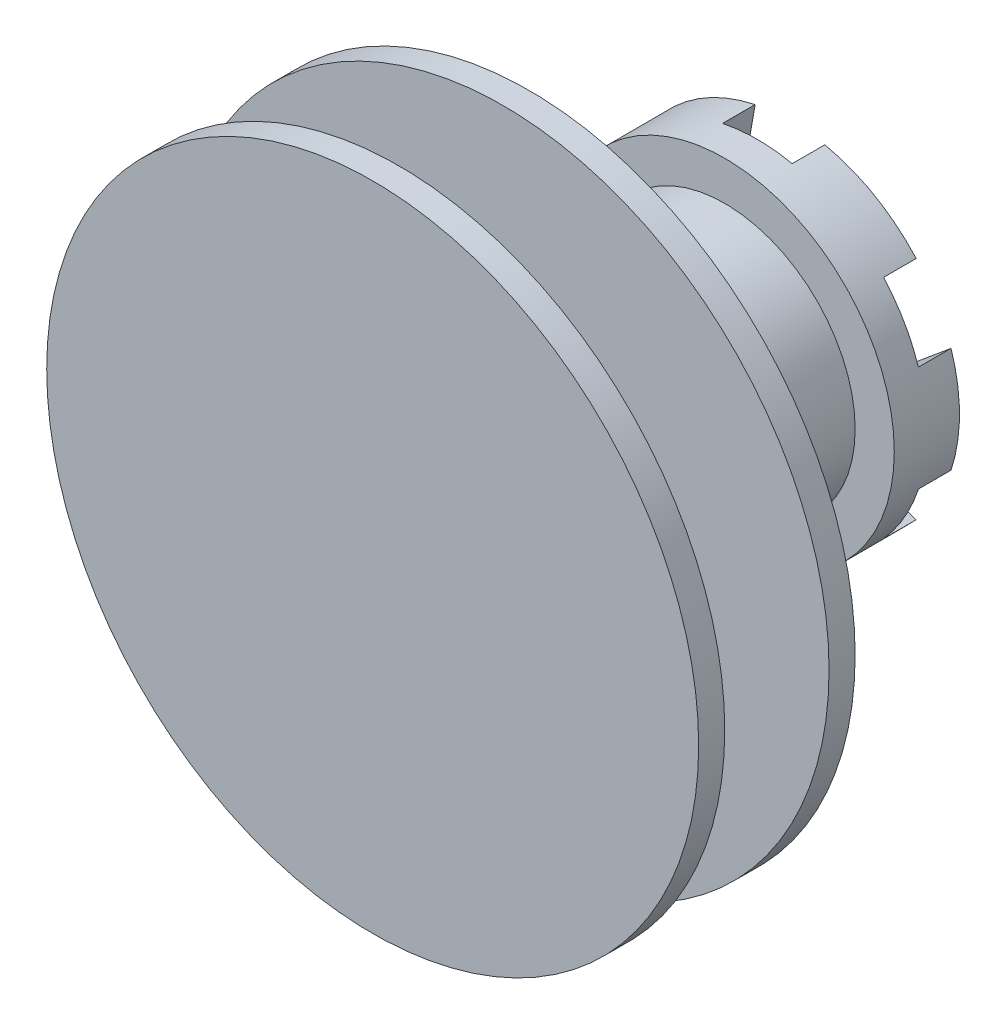
ISO-10303-21;
HEADER;
FILE_DESCRIPTION(('STEP AP214'),'2;1');
FILE_NAME('part.step','',(''),(''),'','','');
FILE_SCHEMA(('AUTOMOTIVE_DESIGN { 1 0 10303 214 1 1 1 1 }'));
ENDSEC;
DATA;
#1=APPLICATION_CONTEXT('core data for automotive mechanical design processes');
#2=APPLICATION_PROTOCOL_DEFINITION('international standard','automotive_design',2000,#1);
#3=PRODUCT_CONTEXT('',#1,'mechanical');
#4=PRODUCT('Part','Part','',(#3));
#5=PRODUCT_RELATED_PRODUCT_CATEGORY('part','',(#4));
#6=PRODUCT_DEFINITION_FORMATION('','',#4);
#7=PRODUCT_DEFINITION_CONTEXT('part definition',#1,'design');
#8=PRODUCT_DEFINITION('design','',#6,#7);
#9=PRODUCT_DEFINITION_SHAPE('','',#8);
#10=(LENGTH_UNIT() NAMED_UNIT(*) SI_UNIT(.MILLI.,.METRE.));
#11=(NAMED_UNIT(*) PLANE_ANGLE_UNIT() SI_UNIT($,.RADIAN.));
#12=(NAMED_UNIT(*) SI_UNIT($,.STERADIAN.) SOLID_ANGLE_UNIT());
#13=UNCERTAINTY_MEASURE_WITH_UNIT(LENGTH_MEASURE(1.E-05),#10,'distance_accuracy_value','');
#14=(GEOMETRIC_REPRESENTATION_CONTEXT(3) GLOBAL_UNCERTAINTY_ASSIGNED_CONTEXT((#13)) GLOBAL_UNIT_ASSIGNED_CONTEXT((#10,
#11,#12)) REPRESENTATION_CONTEXT('',''));
#15=CARTESIAN_POINT('',(0.,0.,0.));
#16=DIRECTION('',(0.,0.,1.));
#17=DIRECTION('',(1.,0.,0.));
#18=AXIS2_PLACEMENT_3D('',#15,#16,#17);
#19=CARTESIAN_POINT('',(0.,0.,5.));
#20=DIRECTION('',(0.,0.,-1.));
#21=DIRECTION('',(-1.,0.,0.));
#22=AXIS2_PLACEMENT_3D('',#19,#20,#21);
#23=CYLINDRICAL_SURFACE('',#22,13.);
#24=CARTESIAN_POINT('',(0.,0.,5.));
#25=DIRECTION('',(0.,0.,1.));
#26=DIRECTION('',(1.,0.,0.));
#27=AXIS2_PLACEMENT_3D('',#24,#25,#26);
#28=CIRCLE('',#27,13.);
#29=CARTESIAN_POINT('',(13.,0.,5.));
#30=VERTEX_POINT('',#29);
#31=EDGE_CURVE('E212',#30,#30,#28,.T.);
#32=ORIENTED_EDGE('',*,*,#31,.F.);
#33=EDGE_LOOP('',(#32));
#34=FACE_BOUND('',#33,.T.);
#35=DIRECTION('',(0.,0.,-1.));
#36=VECTOR('',#35,1.);
#37=CARTESIAN_POINT('',(9.6820807161264,8.67509729089037,5.));
#38=LINE('',#37,#36);
#39=CARTESIAN_POINT('',(9.6820807161264,8.67509729089037,0.));
#40=VERTEX_POINT('',#39);
#41=CARTESIAN_POINT('',(9.6820807161264,8.67509729089037,2.5));
#42=VERTEX_POINT('',#41);
#43=EDGE_CURVE('E57',#40,#42,#38,.F.);
#44=ORIENTED_EDGE('',*,*,#43,.F.);
#45=CARTESIAN_POINT('',(0.,0.,0.));
#46=DIRECTION('',(0.,0.,1.));
#47=DIRECTION('',(1.,0.,0.));
#48=AXIS2_PLACEMENT_3D('',#45,#46,#47);
#49=CIRCLE('',#48,13.);
#50=CARTESIAN_POINT('',(2.67181427614945,12.7224765071021,0.));
#51=VERTEX_POINT('',#50);
#52=EDGE_CURVE('E216',#40,#51,#49,.T.);
#53=ORIENTED_EDGE('',*,*,#52,.T.);
#54=DIRECTION('',(0.,0.,-1.));
#55=VECTOR('',#54,1.);
#56=CARTESIAN_POINT('',(2.67181427614945,12.7224765071021,5.));
#57=LINE('',#56,#55);
#58=CARTESIAN_POINT('',(2.67181427614945,12.7224765071021,2.5));
#59=VERTEX_POINT('',#58);
#60=EDGE_CURVE('E208',#59,#51,#57,.T.);
#61=ORIENTED_EDGE('',*,*,#60,.F.);
#62=CARTESIAN_POINT('',(0.,0.,2.5));
#63=DIRECTION('',(0.,0.,1.));
#64=DIRECTION('',(1.,0.,0.));
#65=AXIS2_PLACEMENT_3D('',#62,#63,#64);
#66=CIRCLE('',#65,13.);
#67=CARTESIAN_POINT('',(-2.67181427614945,12.7224765071021,2.5));
#68=VERTEX_POINT('',#67);
#69=EDGE_CURVE('E175',#59,#68,#66,.T.);
#70=ORIENTED_EDGE('',*,*,#69,.T.);
#71=DIRECTION('',(0.,0.,-1.));
#72=VECTOR('',#71,1.);
#73=CARTESIAN_POINT('',(-2.67181427614945,12.7224765071021,5.));
#74=LINE('',#73,#72);
#75=CARTESIAN_POINT('',(-2.67181427614945,12.7224765071021,0.));
#76=VERTEX_POINT('',#75);
#77=EDGE_CURVE('E206',#76,#68,#74,.F.);
#78=ORIENTED_EDGE('',*,*,#77,.F.);
#79=CARTESIAN_POINT('',(-9.68208071612629,8.67509729089049,0.));
#80=VERTEX_POINT('',#79);
#81=EDGE_CURVE('E304',#76,#80,#49,.T.);
#82=ORIENTED_EDGE('',*,*,#81,.T.);
#83=DIRECTION('',(0.,0.,-1.));
#84=VECTOR('',#83,1.);
#85=CARTESIAN_POINT('',(-9.68208071612628,8.67509729089049,5.));
#86=LINE('',#85,#84);
#87=CARTESIAN_POINT('',(-9.68208071612628,8.67509729089049,2.5));
#88=VERTEX_POINT('',#87);
#89=EDGE_CURVE('E204',#88,#80,#86,.T.);
#90=ORIENTED_EDGE('',*,*,#89,.F.);
#91=CARTESIAN_POINT('',(-12.3538949922758,4.04737921621182,2.5));
#92=VERTEX_POINT('',#91);
#93=EDGE_CURVE('E236',#88,#92,#66,.T.);
#94=ORIENTED_EDGE('',*,*,#93,.T.);
#95=DIRECTION('',(0.,0.,-1.));
#96=VECTOR('',#95,1.);
#97=CARTESIAN_POINT('',(-12.3538949922758,4.04737921621182,5.));
#98=LINE('',#97,#96);
#99=CARTESIAN_POINT('',(-12.3538949922758,4.04737921621182,0.));
#100=VERTEX_POINT('',#99);
#101=EDGE_CURVE('E202',#100,#92,#98,.F.);
#102=ORIENTED_EDGE('',*,*,#101,.F.);
#103=CARTESIAN_POINT('',(-12.3538949922759,-4.04737921621156,0.));
#104=VERTEX_POINT('',#103);
#105=EDGE_CURVE('E303',#100,#104,#49,.T.);
#106=ORIENTED_EDGE('',*,*,#105,.T.);
#107=DIRECTION('',(0.,0.,-1.));
#108=VECTOR('',#107,1.);
#109=CARTESIAN_POINT('',(-12.3538949922759,-4.04737921621156,5.));
#110=LINE('',#109,#108);
#111=CARTESIAN_POINT('',(-12.3538949922759,-4.04737921621156,2.5));
#112=VERTEX_POINT('',#111);
#113=EDGE_CURVE('E200',#112,#104,#110,.T.);
#114=ORIENTED_EDGE('',*,*,#113,.F.);
#115=CARTESIAN_POINT('',(-9.68208071612646,-8.6750972908903,2.5));
#116=VERTEX_POINT('',#115);
#117=EDGE_CURVE('E235',#112,#116,#66,.T.);
#118=ORIENTED_EDGE('',*,*,#117,.T.);
#119=DIRECTION('',(0.,0.,-1.));
#120=VECTOR('',#119,1.);
#121=CARTESIAN_POINT('',(-9.68208071612646,-8.6750972908903,5.));
#122=LINE('',#121,#120);
#123=CARTESIAN_POINT('',(-9.68208071612646,-8.6750972908903,0.));
#124=VERTEX_POINT('',#123);
#125=EDGE_CURVE('E198',#124,#116,#122,.F.);
#126=ORIENTED_EDGE('',*,*,#125,.F.);
#127=CARTESIAN_POINT('',(-2.67181427614954,-12.7224765071021,0.));
#128=VERTEX_POINT('',#127);
#129=EDGE_CURVE('E305',#124,#128,#49,.T.);
#130=ORIENTED_EDGE('',*,*,#129,.T.);
#131=DIRECTION('',(0.,0.,-1.));
#132=VECTOR('',#131,1.);
#133=CARTESIAN_POINT('',(-2.67181427614954,-12.722476507102,5.));
#134=LINE('',#133,#132);
#135=CARTESIAN_POINT('',(-2.67181427614954,-12.722476507102,2.5));
#136=VERTEX_POINT('',#135);
#137=EDGE_CURVE('E196',#136,#128,#134,.T.);
#138=ORIENTED_EDGE('',*,*,#137,.F.);
#139=CARTESIAN_POINT('',(2.67181427614936,-12.7224765071021,2.5));
#140=VERTEX_POINT('',#139);
#141=EDGE_CURVE('E230',#136,#140,#66,.T.);
#142=ORIENTED_EDGE('',*,*,#141,.T.);
#143=DIRECTION('',(0.,0.,-1.));
#144=VECTOR('',#143,1.);
#145=CARTESIAN_POINT('',(2.67181427614936,-12.7224765071021,5.));
#146=LINE('',#145,#144);
#147=CARTESIAN_POINT('',(2.67181427614936,-12.7224765071021,0.));
#148=VERTEX_POINT('',#147);
#149=EDGE_CURVE('E194',#148,#140,#146,.F.);
#150=ORIENTED_EDGE('',*,*,#149,.F.);
#151=CARTESIAN_POINT('',(9.68208071612633,-8.67509729089043,0.));
#152=VERTEX_POINT('',#151);
#153=EDGE_CURVE('E219',#148,#152,#49,.T.);
#154=ORIENTED_EDGE('',*,*,#153,.T.);
#155=DIRECTION('',(0.,0.,-1.));
#156=VECTOR('',#155,1.);
#157=CARTESIAN_POINT('',(9.68208071612634,-8.67509729089044,5.));
#158=LINE('',#157,#156);
#159=CARTESIAN_POINT('',(9.68208071612633,-8.67509729089043,2.5));
#160=VERTEX_POINT('',#159);
#161=EDGE_CURVE('E192',#160,#152,#158,.T.);
#162=ORIENTED_EDGE('',*,*,#161,.F.);
#163=CARTESIAN_POINT('',(12.3538949922758,-4.04737921621173,2.5));
#164=VERTEX_POINT('',#163);
#165=EDGE_CURVE('E36',#160,#164,#66,.T.);
#166=ORIENTED_EDGE('',*,*,#165,.T.);
#167=DIRECTION('',(0.,0.,-1.));
#168=VECTOR('',#167,1.);
#169=CARTESIAN_POINT('',(12.3538949922758,-4.04737921621173,5.));
#170=LINE('',#169,#168);
#171=CARTESIAN_POINT('',(12.3538949922758,-4.04737921621173,0.));
#172=VERTEX_POINT('',#171);
#173=EDGE_CURVE('E185',#172,#164,#170,.F.);
#174=ORIENTED_EDGE('',*,*,#173,.F.);
#175=CARTESIAN_POINT('',(12.3538949922758,4.04737921621165,0.));
#176=VERTEX_POINT('',#175);
#177=EDGE_CURVE('E211',#172,#176,#49,.T.);
#178=ORIENTED_EDGE('',*,*,#177,.T.);
#179=DIRECTION('',(0.,0.,-1.));
#180=VECTOR('',#179,1.);
#181=CARTESIAN_POINT('',(12.3538949922758,4.04737921621165,5.));
#182=LINE('',#181,#180);
#183=CARTESIAN_POINT('',(12.3538949922758,4.04737921621165,2.5));
#184=VERTEX_POINT('',#183);
#185=EDGE_CURVE('E49',#184,#176,#182,.T.);
#186=ORIENTED_EDGE('',*,*,#185,.F.);
#187=EDGE_CURVE('E41',#184,#42,#66,.T.);
#188=ORIENTED_EDGE('',*,*,#187,.T.);
#189=EDGE_LOOP('',(#44,#53,#61,#70,#78,#82,#90,#94,#102,#106,#114,#118,#126,#130,#138,#142,#150,
#154,#162,#166,#174,#178,#186,#188));
#190=FACE_BOUND('',#189,.T.);
#191=ADVANCED_FACE('F33',(#34,#190),#23,.T.);
#192=CARTESIAN_POINT('',(0.,0.,0.));
#193=DIRECTION('',(0.,0.,1.));
#194=DIRECTION('',(1.,0.,0.));
#195=AXIS2_PLACEMENT_3D('',#192,#193,#194);
#196=PLANE('',#195);
#197=DIRECTION('',(0.93863005874561,0.344925517784945,0.));
#198=VECTOR('',#197,1.);
#199=CARTESIAN_POINT('',(-1.65671533325682,4.50834377394235,0.));
#200=LINE('',#199,#198);
#201=CARTESIAN_POINT('',(3.75,6.49519052838327,0.));
#202=VERTEX_POINT('',#201);
#203=EDGE_CURVE('E228',#202,#40,#200,.T.);
#204=ORIENTED_EDGE('',*,*,#203,.F.);
#205=DIRECTION('',(-0.170600768557539,0.985340234521851,0.));
#206=VECTOR('',#205,1.);
#207=CARTESIAN_POINT('',(3.75,6.49519052838327,0.));
#208=LINE('',#207,#206);
#209=EDGE_CURVE('E182',#202,#51,#208,.T.);
#210=ORIENTED_EDGE('',*,*,#209,.T.);
#211=ORIENTED_EDGE('',*,*,#52,.F.);
#212=EDGE_LOOP('',(#204,#210,#211));
#213=FACE_BOUND('',#212,.T.);
#214=ADVANCED_FACE('F331',(#213),#196,.F.);
#215=DIRECTION('',(0.170600768557539,0.985340234521851,0.));
#216=VECTOR('',#215,1.);
#217=CARTESIAN_POINT('',(-4.73269790385589,0.819414321531558,0.));
#218=LINE('',#217,#216);
#219=CARTESIAN_POINT('',(-3.75,6.49519052838327,0.));
#220=VERTEX_POINT('',#219);
#221=EDGE_CURVE('E227',#220,#76,#218,.T.);
#222=ORIENTED_EDGE('',*,*,#221,.F.);
#223=DIRECTION('',(-0.938630058745602,0.344925517784969,0.));
#224=VECTOR('',#223,1.);
#225=CARTESIAN_POINT('',(-3.75,6.49519052838327,0.));
#226=LINE('',#225,#224);
#227=EDGE_CURVE('E280',#220,#80,#226,.T.);
#228=ORIENTED_EDGE('',*,*,#227,.T.);
#229=ORIENTED_EDGE('',*,*,#81,.F.);
#230=EDGE_LOOP('',(#222,#228,#229));
#231=FACE_BOUND('',#230,.T.);
#232=ADVANCED_FACE('F341',(#231),#196,.F.);
#233=DIRECTION('',(-0.768029290188063,0.640414716736913,0.));
#234=VECTOR('',#233,1.);
#235=CARTESIAN_POINT('',(-3.07598257059911,-3.68892945241075,0.));
#236=LINE('',#235,#234);
#237=CARTESIAN_POINT('',(-7.49999999999998,0.,0.));
#238=VERTEX_POINT('',#237);
#239=EDGE_CURVE('E225',#238,#100,#236,.T.);
#240=ORIENTED_EDGE('',*,*,#239,.F.);
#241=DIRECTION('',(-0.768029290188076,-0.640414716736897,0.));
#242=VECTOR('',#241,1.);
#243=CARTESIAN_POINT('',(-7.49999999999998,0.,0.));
#244=LINE('',#243,#242);
#245=EDGE_CURVE('E284',#238,#104,#244,.T.);
#246=ORIENTED_EDGE('',*,*,#245,.T.);
#247=ORIENTED_EDGE('',*,*,#105,.F.);
#248=EDGE_LOOP('',(#240,#246,#247));
#249=FACE_BOUND('',#248,.T.);
#250=ADVANCED_FACE('F302',(#249),#196,.F.);
#251=DIRECTION('',(-0.938630058745613,-0.344925517784939,0.));
#252=VECTOR('',#251,1.);
#253=CARTESIAN_POINT('',(1.65671533325678,-4.50834377394236,0.));
#254=LINE('',#253,#252);
#255=CARTESIAN_POINT('',(-3.75000000000005,-6.49519052838325,0.));
#256=VERTEX_POINT('',#255);
#257=EDGE_CURVE('E223',#256,#124,#254,.T.);
#258=ORIENTED_EDGE('',*,*,#257,.F.);
#259=DIRECTION('',(0.170600768557532,-0.985340234521853,0.));
#260=VECTOR('',#259,1.);
#261=CARTESIAN_POINT('',(-3.75000000000005,-6.49519052838325,0.));
#262=LINE('',#261,#260);
#263=EDGE_CURVE('E286',#256,#128,#262,.T.);
#264=ORIENTED_EDGE('',*,*,#263,.T.);
#265=ORIENTED_EDGE('',*,*,#129,.F.);
#266=EDGE_LOOP('',(#258,#264,#265));
#267=FACE_BOUND('',#266,.T.);
#268=ADVANCED_FACE('F339',(#267),#196,.F.);
#269=DIRECTION('',(-0.170600768557546,-0.98534023452185,0.));
#270=VECTOR('',#269,1.);
#271=CARTESIAN_POINT('',(4.73269790385589,-0.819414321531592,0.));
#272=LINE('',#271,#270);
#273=CARTESIAN_POINT('',(3.74999999999995,-6.4951905283833,0.));
#274=VERTEX_POINT('',#273);
#275=EDGE_CURVE('E221',#274,#148,#272,.T.);
#276=ORIENTED_EDGE('',*,*,#275,.F.);
#277=DIRECTION('',(0.938630058745608,-0.344925517784952,0.));
#278=VECTOR('',#277,1.);
#279=CARTESIAN_POINT('',(3.74999999999995,-6.4951905283833,0.));
#280=LINE('',#279,#278);
#281=EDGE_CURVE('E289',#274,#152,#280,.T.);
#282=ORIENTED_EDGE('',*,*,#281,.T.);
#283=ORIENTED_EDGE('',*,*,#153,.F.);
#284=EDGE_LOOP('',(#276,#282,#283));
#285=FACE_BOUND('',#284,.T.);
#286=ADVANCED_FACE('F313',(#285),#196,.F.);
#287=DIRECTION('',(0.768029290188066,-0.640414716736909,0.));
#288=VECTOR('',#287,1.);
#289=CARTESIAN_POINT('',(3.07598257059911,3.68892945241079,0.));
#290=LINE('',#289,#288);
#291=CARTESIAN_POINT('',(7.5,0.,0.));
#292=VERTEX_POINT('',#291);
#293=EDGE_CURVE('E215',#292,#172,#290,.T.);
#294=ORIENTED_EDGE('',*,*,#293,.F.);
#295=DIRECTION('',(0.768029290188072,0.640414716736903,0.));
#296=VECTOR('',#295,1.);
#297=CARTESIAN_POINT('',(7.5,0.,0.));
#298=LINE('',#297,#296);
#299=EDGE_CURVE('E168',#292,#176,#298,.T.);
#300=ORIENTED_EDGE('',*,*,#299,.T.);
#301=ORIENTED_EDGE('',*,*,#177,.F.);
#302=EDGE_LOOP('',(#294,#300,#301));
#303=FACE_BOUND('',#302,.T.);
#304=ADVANCED_FACE('F328',(#303),#196,.F.);
#305=CARTESIAN_POINT('',(0.,0.,5.));
#306=DIRECTION('',(0.,0.,1.));
#307=DIRECTION('',(1.,0.,0.));
#308=AXIS2_PLACEMENT_3D('',#305,#306,#307);
#309=PLANE('',#308);
#310=CARTESIAN_POINT('',(0.,0.,5.));
#311=DIRECTION('',(0.,0.,1.));
#312=DIRECTION('',(1.,0.,0.));
#313=AXIS2_PLACEMENT_3D('',#310,#311,#312);
#314=CIRCLE('',#313,10.);
#315=CARTESIAN_POINT('',(10.,0.,5.));
#316=VERTEX_POINT('',#315);
#317=EDGE_CURVE('E11',#316,#316,#314,.T.);
#318=ORIENTED_EDGE('',*,*,#317,.F.);
#319=EDGE_LOOP('',(#318));
#320=FACE_BOUND('',#319,.T.);
#321=ORIENTED_EDGE('',*,*,#31,.T.);
#322=EDGE_LOOP('',(#321));
#323=FACE_BOUND('',#322,.T.);
#324=ADVANCED_FACE('F330',(#320,#323),#309,.T.);
#325=CARTESIAN_POINT('',(11.6913429510899,6.74999999999997,2.5));
#326=DIRECTION('',(0.,0.,1.));
#327=DIRECTION('',(1.,0.,0.));
#328=AXIS2_PLACEMENT_3D('',#325,#326,#327);
#329=PLANE('',#328);
#330=DIRECTION('',(0.768029290188072,0.640414716736903,0.));
#331=VECTOR('',#330,1.);
#332=CARTESIAN_POINT('',(7.5,0.,2.5));
#333=LINE('',#332,#331);
#334=CARTESIAN_POINT('',(7.5,0.,2.5));
#335=VERTEX_POINT('',#334);
#336=EDGE_CURVE('E276',#335,#184,#333,.T.);
#337=ORIENTED_EDGE('',*,*,#336,.F.);
#338=DIRECTION('',(-0.768029290188066,0.640414716736909,0.));
#339=VECTOR('',#338,1.);
#340=CARTESIAN_POINT('',(7.5,0.,2.5));
#341=LINE('',#340,#339);
#342=EDGE_CURVE('E274',#164,#335,#341,.T.);
#343=ORIENTED_EDGE('',*,*,#342,.F.);
#344=ORIENTED_EDGE('',*,*,#165,.F.);
#345=DIRECTION('',(0.938630058745608,-0.344925517784952,0.));
#346=VECTOR('',#345,1.);
#347=CARTESIAN_POINT('',(3.74999999999995,-6.4951905283833,2.5));
#348=LINE('',#347,#346);
#349=CARTESIAN_POINT('',(3.74999999999995,-6.4951905283833,2.5));
#350=VERTEX_POINT('',#349);
#351=EDGE_CURVE('E271',#350,#160,#348,.T.);
#352=ORIENTED_EDGE('',*,*,#351,.F.);
#353=DIRECTION('',(0.170600768557546,0.98534023452185,0.));
#354=VECTOR('',#353,1.);
#355=CARTESIAN_POINT('',(3.74999999999995,-6.4951905283833,2.5));
#356=LINE('',#355,#354);
#357=EDGE_CURVE('E269',#140,#350,#356,.T.);
#358=ORIENTED_EDGE('',*,*,#357,.F.);
#359=ORIENTED_EDGE('',*,*,#141,.F.);
#360=DIRECTION('',(0.170600768557532,-0.985340234521853,0.));
#361=VECTOR('',#360,1.);
#362=CARTESIAN_POINT('',(-3.75000000000005,-6.49519052838325,2.5));
#363=LINE('',#362,#361);
#364=CARTESIAN_POINT('',(-3.75000000000005,-6.49519052838325,2.5));
#365=VERTEX_POINT('',#364);
#366=EDGE_CURVE('E261',#365,#136,#363,.T.);
#367=ORIENTED_EDGE('',*,*,#366,.F.);
#368=DIRECTION('',(0.938630058745612,0.344925517784939,0.));
#369=VECTOR('',#368,1.);
#370=CARTESIAN_POINT('',(-3.75000000000005,-6.49519052838325,2.5));
#371=LINE('',#370,#369);
#372=EDGE_CURVE('E253',#116,#365,#371,.T.);
#373=ORIENTED_EDGE('',*,*,#372,.F.);
#374=ORIENTED_EDGE('',*,*,#117,.F.);
#375=DIRECTION('',(-0.768029290188076,-0.640414716736897,0.));
#376=VECTOR('',#375,1.);
#377=CARTESIAN_POINT('',(-7.49999999999998,0.,2.5));
#378=LINE('',#377,#376);
#379=CARTESIAN_POINT('',(-7.49999999999998,0.,2.5));
#380=VERTEX_POINT('',#379);
#381=EDGE_CURVE('E251',#380,#112,#378,.T.);
#382=ORIENTED_EDGE('',*,*,#381,.F.);
#383=DIRECTION('',(0.768029290188063,-0.640414716736913,0.));
#384=VECTOR('',#383,1.);
#385=CARTESIAN_POINT('',(-7.49999999999998,0.,2.5));
#386=LINE('',#385,#384);
#387=EDGE_CURVE('E259',#92,#380,#386,.T.);
#388=ORIENTED_EDGE('',*,*,#387,.F.);
#389=ORIENTED_EDGE('',*,*,#93,.F.);
#390=DIRECTION('',(-0.938630058745602,0.344925517784969,0.));
#391=VECTOR('',#390,1.);
#392=CARTESIAN_POINT('',(-3.75,6.49519052838327,2.5));
#393=LINE('',#392,#391);
#394=CARTESIAN_POINT('',(-3.75,6.49519052838327,2.5));
#395=VERTEX_POINT('',#394);
#396=EDGE_CURVE('E263',#395,#88,#393,.T.);
#397=ORIENTED_EDGE('',*,*,#396,.F.);
#398=DIRECTION('',(-0.170600768557539,-0.985340234521851,0.));
#399=VECTOR('',#398,1.);
#400=CARTESIAN_POINT('',(-3.75,6.49519052838327,2.5));
#401=LINE('',#400,#399);
#402=EDGE_CURVE('E178',#68,#395,#401,.T.);
#403=ORIENTED_EDGE('',*,*,#402,.F.);
#404=ORIENTED_EDGE('',*,*,#69,.F.);
#405=DIRECTION('',(-0.170600768557539,0.985340234521851,0.));
#406=VECTOR('',#405,1.);
#407=CARTESIAN_POINT('',(3.75,6.49519052838327,2.5));
#408=LINE('',#407,#406);
#409=CARTESIAN_POINT('',(3.75,6.49519052838327,2.5));
#410=VERTEX_POINT('',#409);
#411=EDGE_CURVE('E167',#410,#59,#408,.T.);
#412=ORIENTED_EDGE('',*,*,#411,.F.);
#413=DIRECTION('',(-0.93863005874561,-0.344925517784945,0.));
#414=VECTOR('',#413,1.);
#415=CARTESIAN_POINT('',(3.75,6.49519052838327,2.5));
#416=LINE('',#415,#414);
#417=EDGE_CURVE('E159',#42,#410,#416,.T.);
#418=ORIENTED_EDGE('',*,*,#417,.F.);
#419=ORIENTED_EDGE('',*,*,#187,.F.);
#420=EDGE_LOOP('',(#337,#343,#344,#352,#358,#359,#367,#373,#374,#382,#388,#389,#397,#403,#404,
#412,#418,#419));
#421=FACE_BOUND('',#420,.T.);
#422=ADVANCED_FACE('F172',(#421),#329,.F.);
#423=CARTESIAN_POINT('',(3.75,6.49519052838327,2.5));
#424=DIRECTION('',(0.344925517784945,-0.93863005874561,0.));
#425=DIRECTION('',(0.93863005874561,0.344925517784945,0.));
#426=AXIS2_PLACEMENT_3D('',#423,#424,#425);
#427=PLANE('',#426);
#428=ORIENTED_EDGE('',*,*,#43,.T.);
#429=ORIENTED_EDGE('',*,*,#417,.T.);
#430=DIRECTION('',(0.,0.,-1.));
#431=VECTOR('',#430,1.);
#432=CARTESIAN_POINT('',(3.75,6.49519052838327,2.5));
#433=LINE('',#432,#431);
#434=EDGE_CURVE('E163',#410,#202,#433,.T.);
#435=ORIENTED_EDGE('',*,*,#434,.T.);
#436=ORIENTED_EDGE('',*,*,#203,.T.);
#437=EDGE_LOOP('',(#428,#429,#435,#436));
#438=FACE_BOUND('',#437,.T.);
#439=ADVANCED_FACE('F161',(#438),#427,.T.);
#440=CARTESIAN_POINT('',(3.75,6.49519052838327,2.5));
#441=DIRECTION('',(-0.985340234521851,-0.170600768557539,0.));
#442=DIRECTION('',(0.170600768557539,-0.985340234521851,0.));
#443=AXIS2_PLACEMENT_3D('',#440,#441,#442);
#444=PLANE('',#443);
#445=ORIENTED_EDGE('',*,*,#60,.T.);
#446=ORIENTED_EDGE('',*,*,#209,.F.);
#447=ORIENTED_EDGE('',*,*,#434,.F.);
#448=ORIENTED_EDGE('',*,*,#411,.T.);
#449=EDGE_LOOP('',(#445,#446,#447,#448));
#450=FACE_BOUND('',#449,.T.);
#451=ADVANCED_FACE('F180',(#450),#444,.T.);
#452=CARTESIAN_POINT('',(-3.75,6.49519052838327,2.5));
#453=DIRECTION('',(0.985340234521851,-0.170600768557539,0.));
#454=DIRECTION('',(0.170600768557539,0.985340234521851,0.));
#455=AXIS2_PLACEMENT_3D('',#452,#453,#454);
#456=PLANE('',#455);
#457=ORIENTED_EDGE('',*,*,#77,.T.);
#458=ORIENTED_EDGE('',*,*,#402,.T.);
#459=DIRECTION('',(0.,0.,-1.));
#460=VECTOR('',#459,1.);
#461=CARTESIAN_POINT('',(-3.75,6.49519052838327,2.5));
#462=LINE('',#461,#460);
#463=EDGE_CURVE('E183',#395,#220,#462,.T.);
#464=ORIENTED_EDGE('',*,*,#463,.T.);
#465=ORIENTED_EDGE('',*,*,#221,.T.);
#466=EDGE_LOOP('',(#457,#458,#464,#465));
#467=FACE_BOUND('',#466,.T.);
#468=ADVANCED_FACE('F404',(#467),#456,.T.);
#469=CARTESIAN_POINT('',(-3.75,6.49519052838327,2.5));
#470=DIRECTION('',(-0.344925517784969,-0.938630058745601,0.));
#471=DIRECTION('',(0.938630058745602,-0.344925517784969,0.));
#472=AXIS2_PLACEMENT_3D('',#469,#470,#471);
#473=PLANE('',#472);
#474=ORIENTED_EDGE('',*,*,#89,.T.);
#475=ORIENTED_EDGE('',*,*,#227,.F.);
#476=ORIENTED_EDGE('',*,*,#463,.F.);
#477=ORIENTED_EDGE('',*,*,#396,.T.);
#478=EDGE_LOOP('',(#474,#475,#476,#477));
#479=FACE_BOUND('',#478,.T.);
#480=ADVANCED_FACE('F413',(#479),#473,.T.);
#481=CARTESIAN_POINT('',(-7.49999999999998,0.,2.5));
#482=DIRECTION('',(0.640414716736913,0.768029290188063,0.));
#483=DIRECTION('',(-0.768029290188063,0.640414716736913,0.));
#484=AXIS2_PLACEMENT_3D('',#481,#482,#483);
#485=PLANE('',#484);
#486=ORIENTED_EDGE('',*,*,#101,.T.);
#487=ORIENTED_EDGE('',*,*,#387,.T.);
#488=DIRECTION('',(0.,0.,-1.));
#489=VECTOR('',#488,1.);
#490=CARTESIAN_POINT('',(-7.49999999999998,0.,2.5));
#491=LINE('',#490,#489);
#492=EDGE_CURVE('E187',#380,#238,#491,.T.);
#493=ORIENTED_EDGE('',*,*,#492,.T.);
#494=ORIENTED_EDGE('',*,*,#239,.T.);
#495=EDGE_LOOP('',(#486,#487,#493,#494));
#496=FACE_BOUND('',#495,.T.);
#497=ADVANCED_FACE('F298',(#496),#485,.T.);
#498=CARTESIAN_POINT('',(-7.49999999999998,0.,2.5));
#499=DIRECTION('',(0.640414716736897,-0.768029290188076,0.));
#500=DIRECTION('',(0.768029290188076,0.640414716736897,0.));
#501=AXIS2_PLACEMENT_3D('',#498,#499,#500);
#502=PLANE('',#501);
#503=ORIENTED_EDGE('',*,*,#113,.T.);
#504=ORIENTED_EDGE('',*,*,#245,.F.);
#505=ORIENTED_EDGE('',*,*,#492,.F.);
#506=ORIENTED_EDGE('',*,*,#381,.T.);
#507=EDGE_LOOP('',(#503,#504,#505,#506));
#508=FACE_BOUND('',#507,.T.);
#509=ADVANCED_FACE('F256',(#508),#502,.T.);
#510=CARTESIAN_POINT('',(-3.75000000000005,-6.49519052838325,2.5));
#511=DIRECTION('',(-0.344925517784939,0.938630058745612,0.));
#512=DIRECTION('',(-0.938630058745613,-0.344925517784939,0.));
#513=AXIS2_PLACEMENT_3D('',#510,#511,#512);
#514=PLANE('',#513);
#515=ORIENTED_EDGE('',*,*,#125,.T.);
#516=ORIENTED_EDGE('',*,*,#372,.T.);
#517=DIRECTION('',(0.,0.,-1.));
#518=VECTOR('',#517,1.);
#519=CARTESIAN_POINT('',(-3.75000000000005,-6.49519052838325,2.5));
#520=LINE('',#519,#518);
#521=EDGE_CURVE('E296',#365,#256,#520,.T.);
#522=ORIENTED_EDGE('',*,*,#521,.T.);
#523=ORIENTED_EDGE('',*,*,#257,.T.);
#524=EDGE_LOOP('',(#515,#516,#522,#523));
#525=FACE_BOUND('',#524,.T.);
#526=ADVANCED_FACE('F440',(#525),#514,.T.);
#527=CARTESIAN_POINT('',(-3.75000000000005,-6.49519052838325,2.5));
#528=DIRECTION('',(0.985340234521853,0.170600768557532,0.));
#529=DIRECTION('',(-0.170600768557532,0.985340234521853,0.));
#530=AXIS2_PLACEMENT_3D('',#527,#528,#529);
#531=PLANE('',#530);
#532=ORIENTED_EDGE('',*,*,#137,.T.);
#533=ORIENTED_EDGE('',*,*,#263,.F.);
#534=ORIENTED_EDGE('',*,*,#521,.F.);
#535=ORIENTED_EDGE('',*,*,#366,.T.);
#536=EDGE_LOOP('',(#532,#533,#534,#535));
#537=FACE_BOUND('',#536,.T.);
#538=ADVANCED_FACE('F449',(#537),#531,.T.);
#539=CARTESIAN_POINT('',(3.74999999999995,-6.4951905283833,2.5));
#540=DIRECTION('',(-0.98534023452185,0.170600768557546,0.));
#541=DIRECTION('',(-0.170600768557546,-0.98534023452185,0.));
#542=AXIS2_PLACEMENT_3D('',#539,#540,#541);
#543=PLANE('',#542);
#544=ORIENTED_EDGE('',*,*,#149,.T.);
#545=ORIENTED_EDGE('',*,*,#357,.T.);
#546=DIRECTION('',(0.,0.,-1.));
#547=VECTOR('',#546,1.);
#548=CARTESIAN_POINT('',(3.74999999999995,-6.4951905283833,2.5));
#549=LINE('',#548,#547);
#550=EDGE_CURVE('E294',#350,#274,#549,.T.);
#551=ORIENTED_EDGE('',*,*,#550,.T.);
#552=ORIENTED_EDGE('',*,*,#275,.T.);
#553=EDGE_LOOP('',(#544,#545,#551,#552));
#554=FACE_BOUND('',#553,.T.);
#555=ADVANCED_FACE('F459',(#554),#543,.T.);
#556=CARTESIAN_POINT('',(3.74999999999995,-6.4951905283833,2.5));
#557=DIRECTION('',(0.344925517784952,0.938630058745608,0.));
#558=DIRECTION('',(-0.938630058745608,0.344925517784952,0.));
#559=AXIS2_PLACEMENT_3D('',#556,#557,#558);
#560=PLANE('',#559);
#561=ORIENTED_EDGE('',*,*,#161,.T.);
#562=ORIENTED_EDGE('',*,*,#281,.F.);
#563=ORIENTED_EDGE('',*,*,#550,.F.);
#564=ORIENTED_EDGE('',*,*,#351,.T.);
#565=EDGE_LOOP('',(#561,#562,#563,#564));
#566=FACE_BOUND('',#565,.T.);
#567=ADVANCED_FACE('F317',(#566),#560,.T.);
#568=CARTESIAN_POINT('',(7.5,0.,2.5));
#569=DIRECTION('',(-0.640414716736909,-0.768029290188066,0.));
#570=DIRECTION('',(0.768029290188066,-0.640414716736909,0.));
#571=AXIS2_PLACEMENT_3D('',#568,#569,#570);
#572=PLANE('',#571);
#573=ORIENTED_EDGE('',*,*,#173,.T.);
#574=ORIENTED_EDGE('',*,*,#342,.T.);
#575=DIRECTION('',(0.,0.,-1.));
#576=VECTOR('',#575,1.);
#577=CARTESIAN_POINT('',(7.5,0.,2.5));
#578=LINE('',#577,#576);
#579=EDGE_CURVE('E278',#335,#292,#578,.T.);
#580=ORIENTED_EDGE('',*,*,#579,.T.);
#581=ORIENTED_EDGE('',*,*,#293,.T.);
#582=EDGE_LOOP('',(#573,#574,#580,#581));
#583=FACE_BOUND('',#582,.T.);
#584=ADVANCED_FACE('F323',(#583),#572,.T.);
#585=CARTESIAN_POINT('',(7.5,0.,2.5));
#586=DIRECTION('',(-0.640414716736903,0.768029290188072,0.));
#587=DIRECTION('',(-0.768029290188072,-0.640414716736903,0.));
#588=AXIS2_PLACEMENT_3D('',#585,#586,#587);
#589=PLANE('',#588);
#590=ORIENTED_EDGE('',*,*,#185,.T.);
#591=ORIENTED_EDGE('',*,*,#299,.F.);
#592=ORIENTED_EDGE('',*,*,#579,.F.);
#593=ORIENTED_EDGE('',*,*,#336,.T.);
#594=EDGE_LOOP('',(#590,#591,#592,#593));
#595=FACE_BOUND('',#594,.T.);
#596=ADVANCED_FACE('F324',(#595),#589,.T.);
#597=CARTESIAN_POINT('',(0.,0.,20.));
#598=DIRECTION('',(0.,0.,-1.));
#599=DIRECTION('',(-1.,0.,0.));
#600=AXIS2_PLACEMENT_3D('',#597,#598,#599);
#601=CYLINDRICAL_SURFACE('',#600,10.);
#602=CARTESIAN_POINT('',(0.,0.,20.));
#603=DIRECTION('',(0.,0.,1.));
#604=DIRECTION('',(1.,0.,0.));
#605=AXIS2_PLACEMENT_3D('',#602,#603,#604);
#606=CIRCLE('',#605,10.);
#607=CARTESIAN_POINT('',(10.,0.,20.));
#608=VERTEX_POINT('',#607);
#609=EDGE_CURVE('E281',#608,#608,#606,.T.);
#610=ORIENTED_EDGE('',*,*,#609,.F.);
#611=EDGE_LOOP('',(#610));
#612=FACE_BOUND('',#611,.T.);
#613=ORIENTED_EDGE('',*,*,#317,.T.);
#614=EDGE_LOOP('',(#613));
#615=FACE_BOUND('',#614,.T.);
#616=ADVANCED_FACE('F493',(#612,#615),#601,.T.);
#617=CARTESIAN_POINT('',(0.,0.,20.));
#618=DIRECTION('',(0.,0.,1.));
#619=DIRECTION('',(1.,0.,0.));
#620=AXIS2_PLACEMENT_3D('',#617,#618,#619);
#621=PLANE('',#620);
#622=ORIENTED_EDGE('',*,*,#609,.T.);
#623=EDGE_LOOP('',(#622));
#624=FACE_BOUND('',#623,.T.);
#625=CARTESIAN_POINT('',(0.,0.,20.));
#626=DIRECTION('',(0.,0.,-1.));
#627=DIRECTION('',(-1.,0.,0.));
#628=AXIS2_PLACEMENT_3D('',#625,#626,#627);
#629=CIRCLE('',#628,25.);
#630=CARTESIAN_POINT('',(-25.,0.,20.));
#631=VERTEX_POINT('',#630);
#632=EDGE_CURVE('E597',#631,#631,#629,.T.);
#633=ORIENTED_EDGE('',*,*,#632,.T.);
#634=EDGE_LOOP('',(#633));
#635=FACE_BOUND('',#634,.T.);
#636=ADVANCED_FACE('F505',(#624,#635),#621,.F.);
#637=CARTESIAN_POINT('',(0.,0.,0.));
#638=DIRECTION('',(0.,0.,-1.));
#639=DIRECTION('',(-1.,0.,0.));
#640=AXIS2_PLACEMENT_3D('',#637,#638,#639);
#641=CYLINDRICAL_SURFACE('',#640,25.);
#642=ORIENTED_EDGE('',*,*,#632,.F.);
#643=EDGE_LOOP('',(#642));
#644=FACE_BOUND('',#643,.T.);
#645=CARTESIAN_POINT('',(0.,0.,22.));
#646=DIRECTION('',(0.,0.,-1.));
#647=DIRECTION('',(-1.,0.,0.));
#648=AXIS2_PLACEMENT_3D('',#645,#646,#647);
#649=CIRCLE('',#648,25.);
#650=CARTESIAN_POINT('',(-25.,0.,22.));
#651=VERTEX_POINT('',#650);
#652=EDGE_CURVE('E594',#651,#651,#649,.T.);
#653=ORIENTED_EDGE('',*,*,#652,.T.);
#654=EDGE_LOOP('',(#653));
#655=FACE_BOUND('',#654,.T.);
#656=ADVANCED_FACE('F515',(#644,#655),#641,.T.);
#657=CARTESIAN_POINT('',(25.,0.,22.));
#658=DIRECTION('',(0.,0.,-1.));
#659=DIRECTION('',(-1.,0.,0.));
#660=AXIS2_PLACEMENT_3D('',#657,#658,#659);
#661=PLANE('',#660);
#662=ORIENTED_EDGE('',*,*,#652,.F.);
#663=EDGE_LOOP('',(#662));
#664=FACE_BOUND('',#663,.T.);
#665=CARTESIAN_POINT('',(0.,0.,22.));
#666=DIRECTION('',(0.,0.,-1.));
#667=DIRECTION('',(-1.,0.,0.));
#668=AXIS2_PLACEMENT_3D('',#665,#666,#667);
#669=CIRCLE('',#668,10.);
#670=CARTESIAN_POINT('',(-10.,0.,22.));
#671=VERTEX_POINT('',#670);
#672=EDGE_CURVE('E591',#671,#671,#669,.T.);
#673=ORIENTED_EDGE('',*,*,#672,.T.);
#674=EDGE_LOOP('',(#673));
#675=FACE_BOUND('',#674,.T.);
#676=ADVANCED_FACE('F525',(#664,#675),#661,.F.);
#677=CARTESIAN_POINT('',(0.,0.,0.));
#678=DIRECTION('',(0.,0.,-1.));
#679=DIRECTION('',(-1.,0.,0.));
#680=AXIS2_PLACEMENT_3D('',#677,#678,#679);
#681=CYLINDRICAL_SURFACE('',#680,10.);
#682=ORIENTED_EDGE('',*,*,#672,.F.);
#683=EDGE_LOOP('',(#682));
#684=FACE_BOUND('',#683,.T.);
#685=CARTESIAN_POINT('',(0.,0.,30.));
#686=DIRECTION('',(0.,0.,-1.));
#687=DIRECTION('',(-1.,0.,0.));
#688=AXIS2_PLACEMENT_3D('',#685,#686,#687);
#689=CIRCLE('',#688,10.);
#690=CARTESIAN_POINT('',(-10.,0.,30.));
#691=VERTEX_POINT('',#690);
#692=EDGE_CURVE('E586',#691,#691,#689,.T.);
#693=ORIENTED_EDGE('',*,*,#692,.T.);
#694=EDGE_LOOP('',(#693));
#695=FACE_BOUND('',#694,.T.);
#696=ADVANCED_FACE('F535',(#684,#695),#681,.T.);
#697=CARTESIAN_POINT('',(10.,0.,30.));
#698=DIRECTION('',(0.,0.,1.));
#699=DIRECTION('',(1.,0.,0.));
#700=AXIS2_PLACEMENT_3D('',#697,#698,#699);
#701=PLANE('',#700);
#702=ORIENTED_EDGE('',*,*,#692,.F.);
#703=EDGE_LOOP('',(#702));
#704=FACE_BOUND('',#703,.T.);
#705=CARTESIAN_POINT('',(0.,0.,30.));
#706=DIRECTION('',(0.,0.,-1.));
#707=DIRECTION('',(-1.,0.,0.));
#708=AXIS2_PLACEMENT_3D('',#705,#706,#707);
#709=CIRCLE('',#708,25.);
#710=CARTESIAN_POINT('',(-25.,0.,30.));
#711=VERTEX_POINT('',#710);
#712=EDGE_CURVE('E583',#711,#711,#709,.T.);
#713=ORIENTED_EDGE('',*,*,#712,.T.);
#714=EDGE_LOOP('',(#713));
#715=FACE_BOUND('',#714,.T.);
#716=ADVANCED_FACE('F545',(#704,#715),#701,.F.);
#717=CARTESIAN_POINT('',(0.,0.,0.));
#718=DIRECTION('',(0.,0.,-1.));
#719=DIRECTION('',(-1.,0.,0.));
#720=AXIS2_PLACEMENT_3D('',#717,#718,#719);
#721=CYLINDRICAL_SURFACE('',#720,25.);
#722=ORIENTED_EDGE('',*,*,#712,.F.);
#723=EDGE_LOOP('',(#722));
#724=FACE_BOUND('',#723,.T.);
#725=CARTESIAN_POINT('',(0.,0.,32.));
#726=DIRECTION('',(0.,0.,-1.));
#727=DIRECTION('',(-1.,0.,0.));
#728=AXIS2_PLACEMENT_3D('',#725,#726,#727);
#729=CIRCLE('',#728,25.);
#730=CARTESIAN_POINT('',(-25.,0.,32.));
#731=VERTEX_POINT('',#730);
#732=EDGE_CURVE('E581',#731,#731,#729,.T.);
#733=ORIENTED_EDGE('',*,*,#732,.T.);
#734=EDGE_LOOP('',(#733));
#735=FACE_BOUND('',#734,.T.);
#736=ADVANCED_FACE('F555',(#724,#735),#721,.T.);
#737=CARTESIAN_POINT('',(25.,0.,32.));
#738=DIRECTION('',(0.,0.,-1.));
#739=DIRECTION('',(-1.,0.,0.));
#740=AXIS2_PLACEMENT_3D('',#737,#738,#739);
#741=PLANE('',#740);
#742=ORIENTED_EDGE('',*,*,#732,.F.);
#743=EDGE_LOOP('',(#742));
#744=FACE_BOUND('',#743,.T.);
#745=ADVANCED_FACE('F565',(#744),#741,.F.);
#746=CLOSED_SHELL('',(#191,#214,#232,#250,#268,#286,#304,#324,#422,#439,#451,#468,#480,#497,
#509,#526,#538,#555,#567,#584,#596,#616,#636,#656,#676,#696,#716,#736,#745));
#747=MANIFOLD_SOLID_BREP('B2',#746);
#748=ADVANCED_BREP_SHAPE_REPRESENTATION('',(#18,#747),#14);
#749=SHAPE_DEFINITION_REPRESENTATION(#9,#748);
ENDSEC;
END-ISO-10303-21;
